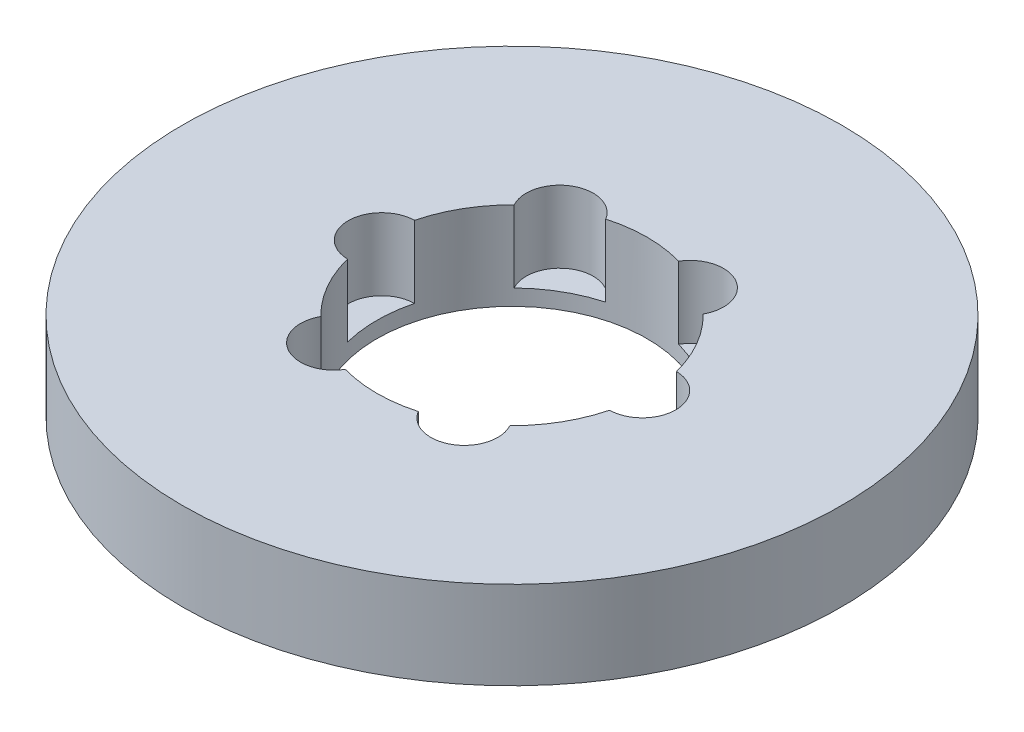
ISO-10303-21;
HEADER;
FILE_DESCRIPTION(('STEP AP214'),'2;1');
FILE_NAME('part.step','',(''),(''),'','','');
FILE_SCHEMA(('AUTOMOTIVE_DESIGN { 1 0 10303 214 1 1 1 1 }'));
ENDSEC;
DATA;
#1=APPLICATION_CONTEXT('core data for automotive mechanical design processes');
#2=APPLICATION_PROTOCOL_DEFINITION('international standard','automotive_design',2000,#1);
#3=PRODUCT_CONTEXT('',#1,'mechanical');
#4=PRODUCT('Part','Part','',(#3));
#5=PRODUCT_RELATED_PRODUCT_CATEGORY('part','',(#4));
#6=PRODUCT_DEFINITION_FORMATION('','',#4);
#7=PRODUCT_DEFINITION_CONTEXT('part definition',#1,'design');
#8=PRODUCT_DEFINITION('design','',#6,#7);
#9=PRODUCT_DEFINITION_SHAPE('','',#8);
#10=(LENGTH_UNIT() NAMED_UNIT(*) SI_UNIT(.MILLI.,.METRE.));
#11=(NAMED_UNIT(*) PLANE_ANGLE_UNIT() SI_UNIT($,.RADIAN.));
#12=(NAMED_UNIT(*) SI_UNIT($,.STERADIAN.) SOLID_ANGLE_UNIT());
#13=UNCERTAINTY_MEASURE_WITH_UNIT(LENGTH_MEASURE(1.E-05),#10,'distance_accuracy_value','');
#14=(GEOMETRIC_REPRESENTATION_CONTEXT(3) GLOBAL_UNCERTAINTY_ASSIGNED_CONTEXT((#13)) GLOBAL_UNIT_ASSIGNED_CONTEXT((#10,
#11,#12)) REPRESENTATION_CONTEXT('',''));
#15=CARTESIAN_POINT('',(0.,0.,0.));
#16=DIRECTION('',(0.,0.,1.));
#17=DIRECTION('',(1.,0.,0.));
#18=AXIS2_PLACEMENT_3D('',#15,#16,#17);
#19=CARTESIAN_POINT('',(0.,26.,0.));
#20=DIRECTION('',(0.,-1.,0.));
#21=DIRECTION('',(0.,0.,-1.));
#22=AXIS2_PLACEMENT_3D('',#19,#20,#21);
#23=CYLINDRICAL_SURFACE('',#22,97.5);
#24=CARTESIAN_POINT('',(0.,26.,0.));
#25=DIRECTION('',(0.,1.,0.));
#26=DIRECTION('',(0.,0.,1.));
#27=AXIS2_PLACEMENT_3D('',#24,#25,#26);
#28=CIRCLE('',#27,97.5);
#29=CARTESIAN_POINT('',(0.,26.,-97.5));
#30=VERTEX_POINT('',#29);
#31=EDGE_CURVE('E162',#30,#30,#28,.T.);
#32=CARTESIAN_POINT('',(0.,0.,0.));
#33=DIRECTION('',(0.,1.,0.));
#34=DIRECTION('',(0.,0.,1.));
#35=AXIS2_PLACEMENT_3D('',#32,#33,#34);
#36=CIRCLE('',#35,97.5);
#37=CARTESIAN_POINT('',(0.,0.,-97.5));
#38=VERTEX_POINT('',#37);
#39=EDGE_CURVE('E157',#38,#38,#36,.T.);
#40=CARTESIAN_POINT('',(0.,26.,-97.5));
#41=CARTESIAN_POINT('',(0.,25.7291666666667,-97.5));
#42=CARTESIAN_POINT('',(0.,25.4583333333333,-97.5));
#43=CARTESIAN_POINT('',(0.,24.9166666666667,-97.5));
#44=CARTESIAN_POINT('',(0.,24.6458333333333,-97.5));
#45=CARTESIAN_POINT('',(0.,24.1041666666667,-97.5));
#46=CARTESIAN_POINT('',(0.,23.8333333333333,-97.5));
#47=CARTESIAN_POINT('',(0.,23.2916666666667,-97.5));
#48=CARTESIAN_POINT('',(0.,23.0208333333333,-97.5));
#49=CARTESIAN_POINT('',(0.,22.4791666666667,-97.5));
#50=CARTESIAN_POINT('',(0.,22.2083333333333,-97.5));
#51=CARTESIAN_POINT('',(0.,21.6666666666667,-97.5));
#52=CARTESIAN_POINT('',(0.,21.3958333333333,-97.5));
#53=CARTESIAN_POINT('',(0.,20.8541666666667,-97.5));
#54=CARTESIAN_POINT('',(0.,20.5833333333333,-97.5));
#55=CARTESIAN_POINT('',(0.,20.0416666666667,-97.5));
#56=CARTESIAN_POINT('',(0.,19.7708333333333,-97.5));
#57=CARTESIAN_POINT('',(0.,19.2291666666667,-97.5));
#58=CARTESIAN_POINT('',(0.,18.9583333333333,-97.5));
#59=CARTESIAN_POINT('',(0.,18.4166666666667,-97.5));
#60=CARTESIAN_POINT('',(0.,18.1458333333333,-97.5));
#61=CARTESIAN_POINT('',(0.,17.6041666666667,-97.5));
#62=CARTESIAN_POINT('',(0.,17.3333333333333,-97.5));
#63=CARTESIAN_POINT('',(0.,16.7916666666667,-97.5));
#64=CARTESIAN_POINT('',(0.,16.5208333333333,-97.5));
#65=CARTESIAN_POINT('',(0.,15.9791666666667,-97.5));
#66=CARTESIAN_POINT('',(0.,15.7083333333333,-97.5));
#67=CARTESIAN_POINT('',(0.,15.1666666666667,-97.5));
#68=CARTESIAN_POINT('',(0.,14.8958333333333,-97.5));
#69=CARTESIAN_POINT('',(0.,14.3541666666667,-97.5));
#70=CARTESIAN_POINT('',(0.,14.0833333333333,-97.5));
#71=CARTESIAN_POINT('',(0.,13.5416666666667,-97.5));
#72=CARTESIAN_POINT('',(0.,13.2708333333333,-97.5));
#73=CARTESIAN_POINT('',(0.,12.7291666666667,-97.5));
#74=CARTESIAN_POINT('',(0.,12.4583333333333,-97.5));
#75=CARTESIAN_POINT('',(0.,11.9166666666667,-97.5));
#76=CARTESIAN_POINT('',(0.,11.6458333333333,-97.5));
#77=CARTESIAN_POINT('',(0.,11.1041666666667,-97.5));
#78=CARTESIAN_POINT('',(0.,10.8333333333333,-97.5));
#79=CARTESIAN_POINT('',(0.,10.2916666666667,-97.5));
#80=CARTESIAN_POINT('',(0.,10.0208333333333,-97.5));
#81=CARTESIAN_POINT('',(0.,9.47916666666667,-97.5));
#82=CARTESIAN_POINT('',(0.,9.20833333333333,-97.5));
#83=CARTESIAN_POINT('',(0.,8.66666666666667,-97.5));
#84=CARTESIAN_POINT('',(0.,8.39583333333333,-97.5));
#85=CARTESIAN_POINT('',(0.,7.85416666666667,-97.5));
#86=CARTESIAN_POINT('',(0.,7.58333333333333,-97.5));
#87=CARTESIAN_POINT('',(0.,7.04166666666667,-97.5));
#88=CARTESIAN_POINT('',(0.,6.77083333333333,-97.5));
#89=CARTESIAN_POINT('',(0.,6.22916666666667,-97.5));
#90=CARTESIAN_POINT('',(0.,5.95833333333333,-97.5));
#91=CARTESIAN_POINT('',(0.,5.41666666666667,-97.5));
#92=CARTESIAN_POINT('',(0.,5.14583333333333,-97.5));
#93=CARTESIAN_POINT('',(0.,4.60416666666667,-97.5));
#94=CARTESIAN_POINT('',(0.,4.33333333333333,-97.5));
#95=CARTESIAN_POINT('',(0.,3.79166666666667,-97.5));
#96=CARTESIAN_POINT('',(0.,3.52083333333333,-97.5));
#97=CARTESIAN_POINT('',(0.,2.97916666666667,-97.5));
#98=CARTESIAN_POINT('',(0.,2.70833333333333,-97.5));
#99=CARTESIAN_POINT('',(0.,2.16666666666667,-97.5));
#100=CARTESIAN_POINT('',(0.,1.89583333333333,-97.5));
#101=CARTESIAN_POINT('',(0.,1.35416666666667,-97.5));
#102=CARTESIAN_POINT('',(0.,1.08333333333333,-97.5));
#103=CARTESIAN_POINT('',(0.,0.541666666666667,-97.5));
#104=CARTESIAN_POINT('',(0.,0.270833333333334,-97.5));
#105=CARTESIAN_POINT('',(0.,0.,-97.5));
#106=B_SPLINE_CURVE_WITH_KNOTS('',3,(#40,#41,#42,#43,#44,#45,#46,#47,#48,#49,#50,#51,#52,#53,
#54,#55,#56,#57,#58,#59,#60,#61,#62,#63,#64,#65,#66,#67,#68,#69,#70,#71,#72,#73,#74,#75,#76,#77,
#78,#79,#80,#81,#82,#83,#84,#85,#86,#87,#88,#89,#90,#91,#92,#93,#94,#95,#96,#97,#98,#99,#100,
#101,#102,#103,#104,#105),.UNSPECIFIED.,.F.,.F.,(4,2,2,2,2,2,2,2,2,2,2,2,2,2,2,2,2,2,2,2,2,2,2,
2,2,2,2,2,2,2,2,2,4),(0.,0.812500000000001,1.625,2.4375,3.25,4.0625,4.875,5.6875,6.5,7.3125,
8.125,8.9375,9.75,10.5625,11.375,12.1875,13.,13.8125,14.625,15.4375,16.25,17.0625,17.875,
18.6875,19.5,20.3125,21.125,21.9375,22.75,23.5625,24.375,25.1875,26.),.UNSPECIFIED.);
#107=EDGE_CURVE('BSEAM39',#30,#38,#106,.T.);
#108=ORIENTED_EDGE('',*,*,#31,.F.);
#109=ORIENTED_EDGE('',*,*,#39,.T.);
#110=ORIENTED_EDGE('',*,*,#107,.T.);
#111=ORIENTED_EDGE('',*,*,#107,.F.);
#112=EDGE_LOOP('',(#108,#110,#109,#111));
#113=FACE_BOUND('',#112,.T.);
#114=ADVANCED_FACE('F39',(#113),#23,.T.);
#115=CARTESIAN_POINT('',(0.,26.,0.));
#116=DIRECTION('',(0.,1.,0.));
#117=DIRECTION('',(0.,0.,1.));
#118=AXIS2_PLACEMENT_3D('',#115,#116,#117);
#119=PLANE('',#118);
#120=CARTESIAN_POINT('',(-19.2786342880537,26.,-33.3915740874475));
#121=DIRECTION('',(0.,1.,0.));
#122=DIRECTION('',(-0.866025403784433,0.,0.50000000000001));
#123=AXIS2_PLACEMENT_3D('',#120,#121,#122);
#124=CIRCLE('',#123,9.91548376857611);
#125=CARTESIAN_POINT('',(-10.7906194419807,26.,-38.5170420990287));
#126=VERTEX_POINT('',#125);
#127=CARTESIAN_POINT('',(-27.9614272154038,26.,-28.6034716088393));
#128=VERTEX_POINT('',#127);
#129=EDGE_CURVE('E218',#126,#128,#124,.T.);
#130=ORIENTED_EDGE('',*,*,#129,.F.);
#131=CARTESIAN_POINT('',(0.,26.,0.));
#132=DIRECTION('',(0.,1.,0.));
#133=DIRECTION('',(0.,0.,1.));
#134=AXIS2_PLACEMENT_3D('',#131,#132,#133);
#135=CIRCLE('',#134,40.);
#136=CARTESIAN_POINT('',(10.7906194419799,26.,-38.5170420990289));
#137=VERTEX_POINT('',#136);
#138=EDGE_CURVE('E169',#137,#126,#135,.T.);
#139=ORIENTED_EDGE('',*,*,#138,.F.);
#140=CARTESIAN_POINT('',(19.278634288053,26.,-33.3915740874479));
#141=DIRECTION('',(0.,1.,0.));
#142=DIRECTION('',(-0.866025403784443,0.,-0.499999999999992));
#143=AXIS2_PLACEMENT_3D('',#140,#141,#142);
#144=CIRCLE('',#143,9.91548376857611);
#145=CARTESIAN_POINT('',(27.9614272154032,26.,-28.6034716088399));
#146=VERTEX_POINT('',#145);
#147=EDGE_CURVE('E285',#146,#137,#144,.T.);
#148=ORIENTED_EDGE('',*,*,#147,.F.);
#149=CARTESIAN_POINT('',(38.7520466573838,26.,-9.91357049018921));
#150=VERTEX_POINT('',#149);
#151=EDGE_CURVE('E174',#150,#146,#135,.T.);
#152=ORIENTED_EDGE('',*,*,#151,.F.);
#153=CARTESIAN_POINT('',(38.5572685761065,26.,0.));
#154=DIRECTION('',(0.,1.,0.));
#155=DIRECTION('',(0.,0.,-1.));
#156=AXIS2_PLACEMENT_3D('',#153,#154,#155);
#157=CIRCLE('',#156,9.91548376857611);
#158=CARTESIAN_POINT('',(38.7520466573838,26.,9.91357049018921));
#159=VERTEX_POINT('',#158);
#160=EDGE_CURVE('E280',#159,#150,#157,.T.);
#161=ORIENTED_EDGE('',*,*,#160,.F.);
#162=CARTESIAN_POINT('',(27.9614272154036,26.,28.6034716088395));
#163=VERTEX_POINT('',#162);
#164=EDGE_CURVE('E164',#163,#159,#135,.T.);
#165=ORIENTED_EDGE('',*,*,#164,.F.);
#166=CARTESIAN_POINT('',(19.2786342880534,26.,33.3915740874476));
#167=DIRECTION('',(0.,1.,0.));
#168=DIRECTION('',(0.866025403784436,0.,-0.500000000000004));
#169=AXIS2_PLACEMENT_3D('',#166,#167,#168);
#170=CIRCLE('',#169,9.91548376857611);
#171=CARTESIAN_POINT('',(10.7906194419805,26.,38.5170420990287));
#172=VERTEX_POINT('',#171);
#173=EDGE_CURVE('E269',#172,#163,#170,.T.);
#174=ORIENTED_EDGE('',*,*,#173,.F.);
#175=CARTESIAN_POINT('',(-10.7906194419802,26.,38.5170420990288));
#176=VERTEX_POINT('',#175);
#177=EDGE_CURVE('E149',#176,#172,#135,.T.);
#178=ORIENTED_EDGE('',*,*,#177,.F.);
#179=CARTESIAN_POINT('',(-19.2786342880532,26.,33.3915740874478));
#180=DIRECTION('',(0.,1.,0.));
#181=DIRECTION('',(0.86602540378444,0.,0.499999999999998));
#182=AXIS2_PLACEMENT_3D('',#179,#180,#181);
#183=CIRCLE('',#182,9.91548376857611);
#184=CARTESIAN_POINT('',(-27.9614272154034,26.,28.6034716088397));
#185=VERTEX_POINT('',#184);
#186=EDGE_CURVE('E128',#185,#176,#183,.T.);
#187=ORIENTED_EDGE('',*,*,#186,.F.);
#188=CARTESIAN_POINT('',(-38.7520466573838,26.,9.91357049018921));
#189=VERTEX_POINT('',#188);
#190=EDGE_CURVE('E148',#189,#185,#135,.T.);
#191=ORIENTED_EDGE('',*,*,#190,.F.);
#192=CARTESIAN_POINT('',(-38.5572685761065,26.,0.));
#193=DIRECTION('',(0.,1.,0.));
#194=DIRECTION('',(0.,0.,1.));
#195=AXIS2_PLACEMENT_3D('',#192,#193,#194);
#196=CIRCLE('',#195,9.91548376857611);
#197=CARTESIAN_POINT('',(-38.7520466573838,26.,-9.91357049018921));
#198=VERTEX_POINT('',#197);
#199=EDGE_CURVE('E179',#198,#189,#196,.T.);
#200=ORIENTED_EDGE('',*,*,#199,.F.);
#201=EDGE_CURVE('E161',#128,#198,#135,.T.);
#202=ORIENTED_EDGE('',*,*,#201,.F.);
#203=EDGE_LOOP('',(#130,#139,#148,#152,#161,#165,#174,#178,#187,#191,#200,#202));
#204=FACE_BOUND('',#203,.T.);
#205=ORIENTED_EDGE('',*,*,#31,.T.);
#206=EDGE_LOOP('',(#205));
#207=FACE_BOUND('',#206,.T.);
#208=ADVANCED_FACE('F141',(#204,#207),#119,.T.);
#209=CARTESIAN_POINT('',(0.,0.,0.));
#210=DIRECTION('',(0.,1.,0.));
#211=DIRECTION('',(0.,0.,1.));
#212=AXIS2_PLACEMENT_3D('',#209,#210,#211);
#213=PLANE('',#212);
#214=CARTESIAN_POINT('',(0.,0.,0.));
#215=DIRECTION('',(0.,1.,0.));
#216=DIRECTION('',(0.,0.,1.));
#217=AXIS2_PLACEMENT_3D('',#214,#215,#216);
#218=CIRCLE('',#217,40.);
#219=CARTESIAN_POINT('',(0.,0.,40.));
#220=VERTEX_POINT('',#219);
#221=EDGE_CURVE('E166',#220,#220,#218,.T.);
#222=ORIENTED_EDGE('',*,*,#221,.T.);
#223=EDGE_LOOP('',(#222));
#224=FACE_BOUND('',#223,.T.);
#225=ORIENTED_EDGE('',*,*,#39,.F.);
#226=EDGE_LOOP('',(#225));
#227=FACE_BOUND('',#226,.T.);
#228=ADVANCED_FACE('F234',(#224,#227),#213,.F.);
#229=CARTESIAN_POINT('',(0.,26.,0.));
#230=DIRECTION('',(0.,-1.,0.));
#231=DIRECTION('',(0.,0.,-1.));
#232=AXIS2_PLACEMENT_3D('',#229,#230,#231);
#233=CYLINDRICAL_SURFACE('',#232,40.);
#234=DIRECTION('',(0.,1.,0.));
#235=VECTOR('',#234,1.);
#236=CARTESIAN_POINT('',(-10.7906194419807,15.3553281125252,-38.5170420990287));
#237=LINE('',#236,#235);
#238=CARTESIAN_POINT('',(-10.7906194419807,4.71065622505031,-38.5170420990287));
#239=VERTEX_POINT('',#238);
#240=EDGE_CURVE('E11',#239,#126,#237,.T.);
#241=ORIENTED_EDGE('',*,*,#240,.F.);
#242=CARTESIAN_POINT('',(0.,4.71065622505031,0.));
#243=DIRECTION('',(0.,1.,0.));
#244=DIRECTION('',(0.,0.,1.));
#245=AXIS2_PLACEMENT_3D('',#242,#243,#244);
#246=CIRCLE('',#245,40.);
#247=CARTESIAN_POINT('',(-27.9614272154038,4.71065622505031,-28.6034716088393));
#248=VERTEX_POINT('',#247);
#249=EDGE_CURVE('E214',#239,#248,#246,.T.);
#250=ORIENTED_EDGE('',*,*,#249,.T.);
#251=DIRECTION('',(0.,1.,0.));
#252=VECTOR('',#251,1.);
#253=CARTESIAN_POINT('',(-27.9614272154038,15.3553281125252,-28.6034716088393));
#254=LINE('',#253,#252);
#255=EDGE_CURVE('E46',#128,#248,#254,.F.);
#256=ORIENTED_EDGE('',*,*,#255,.F.);
#257=ORIENTED_EDGE('',*,*,#201,.T.);
#258=DIRECTION('',(0.,1.,0.));
#259=VECTOR('',#258,1.);
#260=CARTESIAN_POINT('',(-38.7520466573838,15.3553281125252,-9.91357049018921));
#261=LINE('',#260,#259);
#262=CARTESIAN_POINT('',(-38.7520466573838,4.71065622505031,-9.91357049018921));
#263=VERTEX_POINT('',#262);
#264=EDGE_CURVE('E187',#263,#198,#261,.T.);
#265=ORIENTED_EDGE('',*,*,#264,.F.);
#266=CARTESIAN_POINT('',(0.,4.71065622505031,0.));
#267=DIRECTION('',(0.,1.,0.));
#268=DIRECTION('',(0.,0.,1.));
#269=AXIS2_PLACEMENT_3D('',#266,#267,#268);
#270=CIRCLE('',#269,40.);
#271=CARTESIAN_POINT('',(-38.7520466573838,4.71065622505031,9.91357049018921));
#272=VERTEX_POINT('',#271);
#273=EDGE_CURVE('E184',#263,#272,#270,.T.);
#274=ORIENTED_EDGE('',*,*,#273,.T.);
#275=DIRECTION('',(0.,1.,0.));
#276=VECTOR('',#275,1.);
#277=CARTESIAN_POINT('',(-38.7520466573838,15.3553281125252,9.91357049018921));
#278=LINE('',#277,#276);
#279=EDGE_CURVE('E158',#189,#272,#278,.F.);
#280=ORIENTED_EDGE('',*,*,#279,.F.);
#281=ORIENTED_EDGE('',*,*,#190,.T.);
#282=DIRECTION('',(0.,1.,0.));
#283=VECTOR('',#282,1.);
#284=CARTESIAN_POINT('',(-27.9614272154034,15.3553281125252,28.6034716088397));
#285=LINE('',#284,#283);
#286=CARTESIAN_POINT('',(-27.9614272154034,4.71065622505031,28.6034716088397));
#287=VERTEX_POINT('',#286);
#288=EDGE_CURVE('E127',#287,#185,#285,.T.);
#289=ORIENTED_EDGE('',*,*,#288,.F.);
#290=CARTESIAN_POINT('',(0.,4.71065622505031,0.));
#291=DIRECTION('',(0.,1.,0.));
#292=DIRECTION('',(0.,0.,1.));
#293=AXIS2_PLACEMENT_3D('',#290,#291,#292);
#294=CIRCLE('',#293,40.);
#295=CARTESIAN_POINT('',(-10.7906194419802,4.71065622505031,38.5170420990288));
#296=VERTEX_POINT('',#295);
#297=EDGE_CURVE('E189',#287,#296,#294,.T.);
#298=ORIENTED_EDGE('',*,*,#297,.T.);
#299=DIRECTION('',(0.,1.,0.));
#300=VECTOR('',#299,1.);
#301=CARTESIAN_POINT('',(-10.7906194419802,15.3553281125252,38.5170420990288));
#302=LINE('',#301,#300);
#303=EDGE_CURVE('E140',#176,#296,#302,.F.);
#304=ORIENTED_EDGE('',*,*,#303,.F.);
#305=ORIENTED_EDGE('',*,*,#177,.T.);
#306=DIRECTION('',(0.,1.,0.));
#307=VECTOR('',#306,1.);
#308=CARTESIAN_POINT('',(10.7906194419805,15.3553281125252,38.5170420990287));
#309=LINE('',#308,#307);
#310=CARTESIAN_POINT('',(10.7906194419805,4.71065622505031,38.5170420990287));
#311=VERTEX_POINT('',#310);
#312=EDGE_CURVE('E196',#311,#172,#309,.T.);
#313=ORIENTED_EDGE('',*,*,#312,.F.);
#314=CARTESIAN_POINT('',(0.,4.71065622505031,0.));
#315=DIRECTION('',(0.,1.,0.));
#316=DIRECTION('',(0.,0.,1.));
#317=AXIS2_PLACEMENT_3D('',#314,#315,#316);
#318=CIRCLE('',#317,40.);
#319=CARTESIAN_POINT('',(27.9614272154036,4.71065622505031,28.6034716088395));
#320=VERTEX_POINT('',#319);
#321=EDGE_CURVE('E136',#311,#320,#318,.T.);
#322=ORIENTED_EDGE('',*,*,#321,.T.);
#323=DIRECTION('',(0.,1.,0.));
#324=VECTOR('',#323,1.);
#325=CARTESIAN_POINT('',(27.9614272154036,15.3553281125252,28.6034716088395));
#326=LINE('',#325,#324);
#327=EDGE_CURVE('E194',#163,#320,#326,.F.);
#328=ORIENTED_EDGE('',*,*,#327,.F.);
#329=ORIENTED_EDGE('',*,*,#164,.T.);
#330=DIRECTION('',(0.,1.,0.));
#331=VECTOR('',#330,1.);
#332=CARTESIAN_POINT('',(38.7520466573838,15.3553281125252,9.91357049018921));
#333=LINE('',#332,#331);
#334=CARTESIAN_POINT('',(38.7520466573838,4.71065622505031,9.91357049018921));
#335=VERTEX_POINT('',#334);
#336=EDGE_CURVE('E206',#335,#159,#333,.T.);
#337=ORIENTED_EDGE('',*,*,#336,.F.);
#338=CARTESIAN_POINT('',(0.,4.71065622505031,0.));
#339=DIRECTION('',(0.,1.,0.));
#340=DIRECTION('',(0.,0.,1.));
#341=AXIS2_PLACEMENT_3D('',#338,#339,#340);
#342=CIRCLE('',#341,40.);
#343=CARTESIAN_POINT('',(38.7520466573838,4.71065622505031,-9.91357049018921));
#344=VERTEX_POINT('',#343);
#345=EDGE_CURVE('E199',#335,#344,#342,.T.);
#346=ORIENTED_EDGE('',*,*,#345,.T.);
#347=DIRECTION('',(0.,1.,0.));
#348=VECTOR('',#347,1.);
#349=CARTESIAN_POINT('',(38.7520466573838,15.3553281125252,-9.91357049018921));
#350=LINE('',#349,#348);
#351=EDGE_CURVE('E201',#150,#344,#350,.F.);
#352=ORIENTED_EDGE('',*,*,#351,.F.);
#353=ORIENTED_EDGE('',*,*,#151,.T.);
#354=DIRECTION('',(0.,1.,0.));
#355=VECTOR('',#354,1.);
#356=CARTESIAN_POINT('',(27.9614272154032,15.3553281125252,-28.6034716088399));
#357=LINE('',#356,#355);
#358=CARTESIAN_POINT('',(27.9614272154032,4.71065622505031,-28.6034716088399));
#359=VERTEX_POINT('',#358);
#360=EDGE_CURVE('E213',#359,#146,#357,.T.);
#361=ORIENTED_EDGE('',*,*,#360,.F.);
#362=CARTESIAN_POINT('',(0.,4.71065622505031,0.));
#363=DIRECTION('',(0.,1.,0.));
#364=DIRECTION('',(0.,0.,1.));
#365=AXIS2_PLACEMENT_3D('',#362,#363,#364);
#366=CIRCLE('',#365,40.);
#367=CARTESIAN_POINT('',(10.7906194419799,4.71065622505031,-38.5170420990289));
#368=VERTEX_POINT('',#367);
#369=EDGE_CURVE('E208',#359,#368,#366,.T.);
#370=ORIENTED_EDGE('',*,*,#369,.T.);
#371=DIRECTION('',(0.,1.,0.));
#372=VECTOR('',#371,1.);
#373=CARTESIAN_POINT('',(10.7906194419799,15.3553281125252,-38.5170420990289));
#374=LINE('',#373,#372);
#375=EDGE_CURVE('E211',#137,#368,#374,.F.);
#376=ORIENTED_EDGE('',*,*,#375,.F.);
#377=ORIENTED_EDGE('',*,*,#138,.T.);
#378=EDGE_LOOP('',(#241,#250,#256,#257,#265,#274,#280,#281,#289,#298,#304,#305,#313,#322,#328,
#329,#337,#346,#352,#353,#361,#370,#376,#377));
#379=FACE_BOUND('',#378,.T.);
#380=ORIENTED_EDGE('',*,*,#221,.F.);
#381=EDGE_LOOP('',(#380));
#382=FACE_BOUND('',#381,.T.);
#383=ADVANCED_FACE('F152',(#379,#382),#233,.F.);
#384=CARTESIAN_POINT('',(-38.5572685761065,4.71065622505031,0.));
#385=DIRECTION('',(0.,1.,0.));
#386=DIRECTION('',(0.,0.,1.));
#387=AXIS2_PLACEMENT_3D('',#384,#385,#386);
#388=CYLINDRICAL_SURFACE('',#387,9.91548376857611);
#389=ORIENTED_EDGE('',*,*,#264,.T.);
#390=ORIENTED_EDGE('',*,*,#199,.T.);
#391=ORIENTED_EDGE('',*,*,#279,.T.);
#392=CARTESIAN_POINT('',(-38.5572685761065,4.71065622505031,0.));
#393=DIRECTION('',(0.,1.,0.));
#394=DIRECTION('',(0.,0.,1.));
#395=AXIS2_PLACEMENT_3D('',#392,#393,#394);
#396=CIRCLE('',#395,9.91548376857611);
#397=EDGE_CURVE('E180',#263,#272,#396,.T.);
#398=ORIENTED_EDGE('',*,*,#397,.F.);
#399=EDGE_LOOP('',(#389,#390,#391,#398));
#400=FACE_BOUND('',#399,.T.);
#401=ADVANCED_FACE('F244',(#400),#388,.F.);
#402=CARTESIAN_POINT('',(-38.5572685761065,4.71065622505031,0.));
#403=DIRECTION('',(0.,1.,0.));
#404=DIRECTION('',(0.,0.,1.));
#405=AXIS2_PLACEMENT_3D('',#402,#403,#404);
#406=PLANE('',#405);
#407=ORIENTED_EDGE('',*,*,#397,.T.);
#408=ORIENTED_EDGE('',*,*,#273,.F.);
#409=EDGE_LOOP('',(#407,#408));
#410=FACE_BOUND('',#409,.T.);
#411=ADVANCED_FACE('F248',(#410),#406,.T.);
#412=CARTESIAN_POINT('',(-19.2786342880532,4.71065622505031,33.3915740874478));
#413=DIRECTION('',(0.,1.,0.));
#414=DIRECTION('',(0.,0.,1.));
#415=AXIS2_PLACEMENT_3D('',#412,#413,#414);
#416=CYLINDRICAL_SURFACE('',#415,9.91548376857611);
#417=ORIENTED_EDGE('',*,*,#288,.T.);
#418=ORIENTED_EDGE('',*,*,#186,.T.);
#419=ORIENTED_EDGE('',*,*,#303,.T.);
#420=CARTESIAN_POINT('',(-19.2786342880532,4.71065622505031,33.3915740874478));
#421=DIRECTION('',(0.,1.,0.));
#422=DIRECTION('',(0.86602540378444,0.,0.499999999999998));
#423=AXIS2_PLACEMENT_3D('',#420,#421,#422);
#424=CIRCLE('',#423,9.91548376857611);
#425=EDGE_CURVE('E135',#287,#296,#424,.T.);
#426=ORIENTED_EDGE('',*,*,#425,.F.);
#427=EDGE_LOOP('',(#417,#418,#419,#426));
#428=FACE_BOUND('',#427,.T.);
#429=ADVANCED_FACE('F126',(#428),#416,.F.);
#430=CARTESIAN_POINT('',(-19.2786342880532,4.71065622505031,33.3915740874478));
#431=DIRECTION('',(0.,1.,0.));
#432=DIRECTION('',(0.86602540378444,0.,0.499999999999998));
#433=AXIS2_PLACEMENT_3D('',#430,#431,#432);
#434=PLANE('',#433);
#435=ORIENTED_EDGE('',*,*,#425,.T.);
#436=ORIENTED_EDGE('',*,*,#297,.F.);
#437=EDGE_LOOP('',(#435,#436));
#438=FACE_BOUND('',#437,.T.);
#439=ADVANCED_FACE('F258',(#438),#434,.T.);
#440=CARTESIAN_POINT('',(19.2786342880534,4.71065622505031,33.3915740874476));
#441=DIRECTION('',(0.,1.,0.));
#442=DIRECTION('',(0.,0.,1.));
#443=AXIS2_PLACEMENT_3D('',#440,#441,#442);
#444=CYLINDRICAL_SURFACE('',#443,9.91548376857611);
#445=ORIENTED_EDGE('',*,*,#312,.T.);
#446=ORIENTED_EDGE('',*,*,#173,.T.);
#447=ORIENTED_EDGE('',*,*,#327,.T.);
#448=CARTESIAN_POINT('',(19.2786342880534,4.71065622505031,33.3915740874476));
#449=DIRECTION('',(0.,1.,0.));
#450=DIRECTION('',(0.866025403784436,0.,-0.500000000000004));
#451=AXIS2_PLACEMENT_3D('',#448,#449,#450);
#452=CIRCLE('',#451,9.91548376857611);
#453=EDGE_CURVE('E147',#311,#320,#452,.T.);
#454=ORIENTED_EDGE('',*,*,#453,.F.);
#455=EDGE_LOOP('',(#445,#446,#447,#454));
#456=FACE_BOUND('',#455,.T.);
#457=ADVANCED_FACE('F256',(#456),#444,.F.);
#458=CARTESIAN_POINT('',(19.2786342880534,4.71065622505031,33.3915740874476));
#459=DIRECTION('',(0.,1.,0.));
#460=DIRECTION('',(0.866025403784436,0.,-0.500000000000004));
#461=AXIS2_PLACEMENT_3D('',#458,#459,#460);
#462=PLANE('',#461);
#463=ORIENTED_EDGE('',*,*,#453,.T.);
#464=ORIENTED_EDGE('',*,*,#321,.F.);
#465=EDGE_LOOP('',(#463,#464));
#466=FACE_BOUND('',#465,.T.);
#467=ADVANCED_FACE('F263',(#466),#462,.T.);
#468=CARTESIAN_POINT('',(38.5572685761065,4.71065622505031,0.));
#469=DIRECTION('',(0.,1.,0.));
#470=DIRECTION('',(0.,0.,1.));
#471=AXIS2_PLACEMENT_3D('',#468,#469,#470);
#472=CYLINDRICAL_SURFACE('',#471,9.91548376857611);
#473=ORIENTED_EDGE('',*,*,#336,.T.);
#474=ORIENTED_EDGE('',*,*,#160,.T.);
#475=ORIENTED_EDGE('',*,*,#351,.T.);
#476=CARTESIAN_POINT('',(38.5572685761065,4.71065622505031,0.));
#477=DIRECTION('',(0.,1.,0.));
#478=DIRECTION('',(0.,0.,-1.));
#479=AXIS2_PLACEMENT_3D('',#476,#477,#478);
#480=CIRCLE('',#479,9.91548376857611);
#481=EDGE_CURVE('E273',#335,#344,#480,.T.);
#482=ORIENTED_EDGE('',*,*,#481,.F.);
#483=EDGE_LOOP('',(#473,#474,#475,#482));
#484=FACE_BOUND('',#483,.T.);
#485=ADVANCED_FACE('F297',(#484),#472,.F.);
#486=CARTESIAN_POINT('',(38.5572685761065,4.71065622505031,0.));
#487=DIRECTION('',(0.,1.,0.));
#488=DIRECTION('',(0.,0.,-1.));
#489=AXIS2_PLACEMENT_3D('',#486,#487,#488);
#490=PLANE('',#489);
#491=ORIENTED_EDGE('',*,*,#481,.T.);
#492=ORIENTED_EDGE('',*,*,#345,.F.);
#493=EDGE_LOOP('',(#491,#492));
#494=FACE_BOUND('',#493,.T.);
#495=ADVANCED_FACE('F299',(#494),#490,.T.);
#496=CARTESIAN_POINT('',(19.278634288053,4.71065622505031,-33.3915740874479));
#497=DIRECTION('',(0.,1.,0.));
#498=DIRECTION('',(0.,0.,1.));
#499=AXIS2_PLACEMENT_3D('',#496,#497,#498);
#500=CYLINDRICAL_SURFACE('',#499,9.91548376857611);
#501=ORIENTED_EDGE('',*,*,#360,.T.);
#502=ORIENTED_EDGE('',*,*,#147,.T.);
#503=ORIENTED_EDGE('',*,*,#375,.T.);
#504=CARTESIAN_POINT('',(19.278634288053,4.71065622505031,-33.3915740874479));
#505=DIRECTION('',(0.,1.,0.));
#506=DIRECTION('',(-0.866025403784443,0.,-0.499999999999992));
#507=AXIS2_PLACEMENT_3D('',#504,#505,#506);
#508=CIRCLE('',#507,9.91548376857611);
#509=EDGE_CURVE('E56',#359,#368,#508,.T.);
#510=ORIENTED_EDGE('',*,*,#509,.F.);
#511=EDGE_LOOP('',(#501,#502,#503,#510));
#512=FACE_BOUND('',#511,.T.);
#513=ADVANCED_FACE('F292',(#512),#500,.F.);
#514=CARTESIAN_POINT('',(19.278634288053,4.71065622505031,-33.3915740874479));
#515=DIRECTION('',(0.,1.,0.));
#516=DIRECTION('',(-0.866025403784443,0.,-0.499999999999992));
#517=AXIS2_PLACEMENT_3D('',#514,#515,#516);
#518=PLANE('',#517);
#519=ORIENTED_EDGE('',*,*,#509,.T.);
#520=ORIENTED_EDGE('',*,*,#369,.F.);
#521=EDGE_LOOP('',(#519,#520));
#522=FACE_BOUND('',#521,.T.);
#523=ADVANCED_FACE('F226',(#522),#518,.T.);
#524=CARTESIAN_POINT('',(-19.2786342880537,4.71065622505031,-33.3915740874475));
#525=DIRECTION('',(0.,1.,0.));
#526=DIRECTION('',(0.,0.,1.));
#527=AXIS2_PLACEMENT_3D('',#524,#525,#526);
#528=CYLINDRICAL_SURFACE('',#527,9.91548376857611);
#529=ORIENTED_EDGE('',*,*,#240,.T.);
#530=ORIENTED_EDGE('',*,*,#129,.T.);
#531=ORIENTED_EDGE('',*,*,#255,.T.);
#532=CARTESIAN_POINT('',(-19.2786342880537,4.71065622505031,-33.3915740874475));
#533=DIRECTION('',(0.,1.,0.));
#534=DIRECTION('',(-0.866025403784433,0.,0.50000000000001));
#535=AXIS2_PLACEMENT_3D('',#532,#533,#534);
#536=CIRCLE('',#535,9.91548376857611);
#537=EDGE_CURVE('E55',#239,#248,#536,.T.);
#538=ORIENTED_EDGE('',*,*,#537,.F.);
#539=EDGE_LOOP('',(#529,#530,#531,#538));
#540=FACE_BOUND('',#539,.T.);
#541=ADVANCED_FACE('F217',(#540),#528,.F.);
#542=CARTESIAN_POINT('',(-19.2786342880537,4.71065622505031,-33.3915740874475));
#543=DIRECTION('',(0.,1.,0.));
#544=DIRECTION('',(-0.866025403784433,0.,0.50000000000001));
#545=AXIS2_PLACEMENT_3D('',#542,#543,#544);
#546=PLANE('',#545);
#547=ORIENTED_EDGE('',*,*,#537,.T.);
#548=ORIENTED_EDGE('',*,*,#249,.F.);
#549=EDGE_LOOP('',(#547,#548));
#550=FACE_BOUND('',#549,.T.);
#551=ADVANCED_FACE('F219',(#550),#546,.T.);
#552=CLOSED_SHELL('',(#114,#208,#228,#383,#401,#411,#429,#439,#457,#467,#485,#495,#513,#523,
#541,#551));
#553=MANIFOLD_SOLID_BREP('B2',#552);
#554=ADVANCED_BREP_SHAPE_REPRESENTATION('',(#18,#553),#14);
#555=SHAPE_DEFINITION_REPRESENTATION(#9,#554);
ENDSEC;
END-ISO-10303-21;
